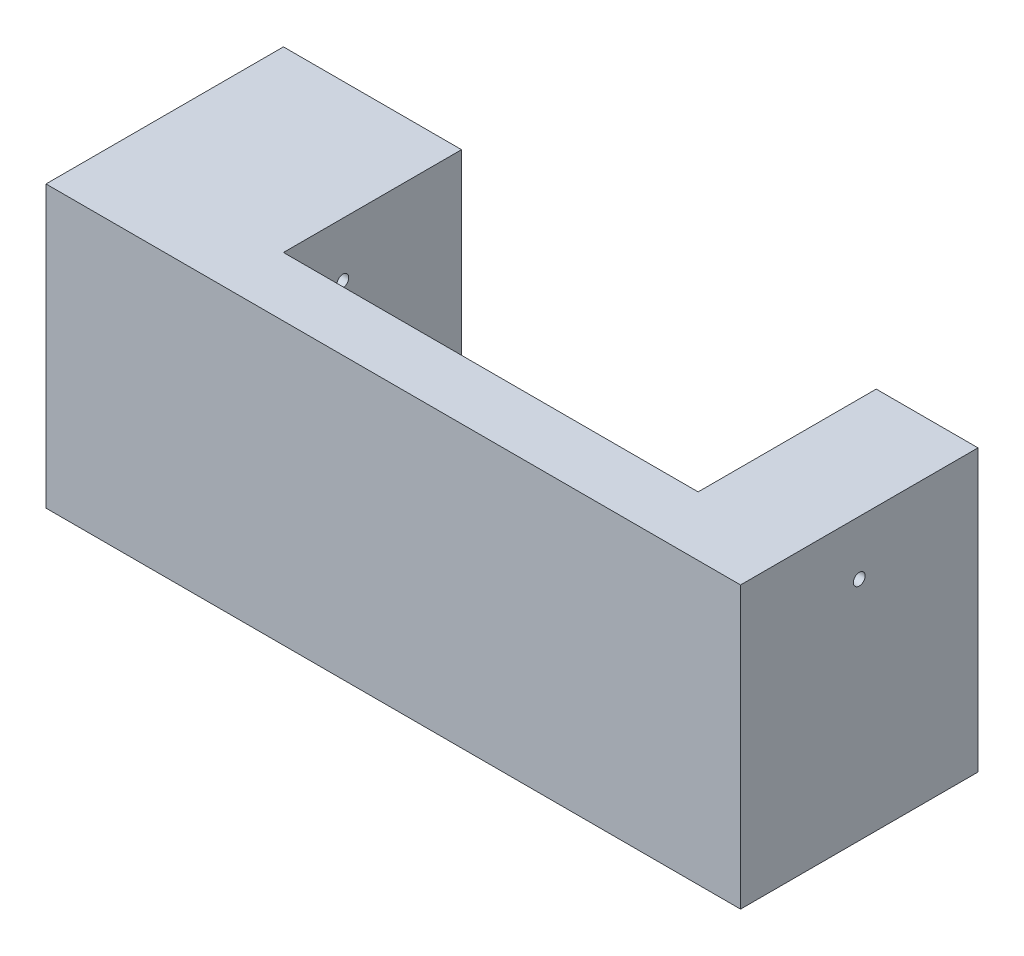
ISO-10303-21;
HEADER;
FILE_DESCRIPTION(('STEP AP214'),'2;1');
FILE_NAME('part.step','',(''),(''),'','','');
FILE_SCHEMA(('AUTOMOTIVE_DESIGN { 1 0 10303 214 1 1 1 1 }'));
ENDSEC;
DATA;
#1=APPLICATION_CONTEXT('core data for automotive mechanical design processes');
#2=APPLICATION_PROTOCOL_DEFINITION('international standard','automotive_design',2000,#1);
#3=PRODUCT_CONTEXT('',#1,'mechanical');
#4=PRODUCT('Part','Part','',(#3));
#5=PRODUCT_RELATED_PRODUCT_CATEGORY('part','',(#4));
#6=PRODUCT_DEFINITION_FORMATION('','',#4);
#7=PRODUCT_DEFINITION_CONTEXT('part definition',#1,'design');
#8=PRODUCT_DEFINITION('design','',#6,#7);
#9=PRODUCT_DEFINITION_SHAPE('','',#8);
#10=(LENGTH_UNIT() NAMED_UNIT(*) SI_UNIT(.MILLI.,.METRE.));
#11=(NAMED_UNIT(*) PLANE_ANGLE_UNIT() SI_UNIT($,.RADIAN.));
#12=(NAMED_UNIT(*) SI_UNIT($,.STERADIAN.) SOLID_ANGLE_UNIT());
#13=UNCERTAINTY_MEASURE_WITH_UNIT(LENGTH_MEASURE(1.E-05),#10,'distance_accuracy_value','');
#14=(GEOMETRIC_REPRESENTATION_CONTEXT(3) GLOBAL_UNCERTAINTY_ASSIGNED_CONTEXT((#13)) GLOBAL_UNIT_ASSIGNED_CONTEXT((#10,
#11,#12)) REPRESENTATION_CONTEXT('',''));
#15=CARTESIAN_POINT('',(0.,0.,0.));
#16=DIRECTION('',(0.,0.,1.));
#17=DIRECTION('',(1.,0.,0.));
#18=AXIS2_PLACEMENT_3D('',#15,#16,#17);
#19=CARTESIAN_POINT('',(117.,23.65,9.99999999999999));
#20=DIRECTION('',(0.,0.,1.));
#21=DIRECTION('',(0.,-1.,0.));
#22=AXIS2_PLACEMENT_3D('',#19,#20,#21);
#23=PLANE('',#22);
#24=DIRECTION('',(0.,1.,0.));
#25=VECTOR('',#24,1.);
#26=CARTESIAN_POINT('',(99.8539832396308,23.65,9.99999999999999));
#27=LINE('',#26,#25);
#28=CARTESIAN_POINT('',(99.8539832396308,-23.65,9.99999999999999));
#29=VERTEX_POINT('',#28);
#30=CARTESIAN_POINT('',(99.8539832396308,23.65,9.99999999999999));
#31=VERTEX_POINT('',#30);
#32=EDGE_CURVE('E179',#29,#31,#27,.T.);
#33=ORIENTED_EDGE('',*,*,#32,.F.);
#34=DIRECTION('',(-1.,0.,0.));
#35=VECTOR('',#34,1.);
#36=CARTESIAN_POINT('',(117.,-23.65,9.99999999999999));
#37=LINE('',#36,#35);
#38=CARTESIAN_POINT('',(30.,-23.65,9.99999999999999));
#39=VERTEX_POINT('',#38);
#40=EDGE_CURVE('E56',#29,#39,#37,.T.);
#41=ORIENTED_EDGE('',*,*,#40,.T.);
#42=DIRECTION('',(0.,1.,0.));
#43=VECTOR('',#42,1.);
#44=CARTESIAN_POINT('',(30.,23.65,9.99999999999999));
#45=LINE('',#44,#43);
#46=CARTESIAN_POINT('',(30.,23.65,9.99999999999999));
#47=VERTEX_POINT('',#46);
#48=EDGE_CURVE('E159',#39,#47,#45,.T.);
#49=ORIENTED_EDGE('',*,*,#48,.T.);
#50=DIRECTION('',(-1.,0.,0.));
#51=VECTOR('',#50,1.);
#52=CARTESIAN_POINT('',(117.,23.65,9.99999999999999));
#53=LINE('',#52,#51);
#54=EDGE_CURVE('E149',#31,#47,#53,.T.);
#55=ORIENTED_EDGE('',*,*,#54,.F.);
#56=EDGE_LOOP('',(#33,#41,#49,#55));
#57=FACE_BOUND('',#56,.T.);
#58=ADVANCED_FACE('F39',(#57),#23,.F.);
#59=CARTESIAN_POINT('',(30.,0.,0.));
#60=DIRECTION('',(-1.,0.,0.));
#61=DIRECTION('',(0.,0.,1.));
#62=AXIS2_PLACEMENT_3D('',#59,#60,#61);
#63=PLANE('',#62);
#64=CARTESIAN_POINT('',(30.,14.4893111638955,0.));
#65=DIRECTION('',(1.,0.,0.));
#66=DIRECTION('',(0.,0.,-1.));
#67=AXIS2_PLACEMENT_3D('',#64,#65,#66);
#68=CIRCLE('',#67,1.);
#69=CARTESIAN_POINT('',(30.,14.4893111638955,-1.));
#70=VERTEX_POINT('',#69);
#71=EDGE_CURVE('E109',#70,#70,#68,.T.);
#72=ORIENTED_EDGE('',*,*,#71,.F.);
#73=EDGE_LOOP('',(#72));
#74=FACE_BOUND('',#73,.T.);
#75=ORIENTED_EDGE('',*,*,#48,.F.);
#76=DIRECTION('',(0.,0.,-1.));
#77=VECTOR('',#76,1.);
#78=CARTESIAN_POINT('',(30.,-23.65,20.));
#79=LINE('',#78,#77);
#80=CARTESIAN_POINT('',(30.,-23.65,-20.));
#81=VERTEX_POINT('',#80);
#82=EDGE_CURVE('E64',#39,#81,#79,.T.);
#83=ORIENTED_EDGE('',*,*,#82,.T.);
#84=DIRECTION('',(0.,1.,0.));
#85=VECTOR('',#84,1.);
#86=CARTESIAN_POINT('',(30.,-23.65,-20.));
#87=LINE('',#86,#85);
#88=CARTESIAN_POINT('',(30.,23.65,-20.));
#89=VERTEX_POINT('',#88);
#90=EDGE_CURVE('E96',#81,#89,#87,.T.);
#91=ORIENTED_EDGE('',*,*,#90,.T.);
#92=DIRECTION('',(0.,0.,1.));
#93=VECTOR('',#92,1.);
#94=CARTESIAN_POINT('',(30.,23.65,20.));
#95=LINE('',#94,#93);
#96=EDGE_CURVE('E169',#89,#47,#95,.T.);
#97=ORIENTED_EDGE('',*,*,#96,.T.);
#98=EDGE_LOOP('',(#75,#83,#91,#97));
#99=FACE_BOUND('',#98,.T.);
#100=ADVANCED_FACE('F174',(#74,#99),#63,.F.);
#101=CARTESIAN_POINT('',(0.,0.,0.));
#102=DIRECTION('',(-1.,0.,0.));
#103=DIRECTION('',(0.,0.,1.));
#104=AXIS2_PLACEMENT_3D('',#101,#102,#103);
#105=PLANE('',#104);
#106=DIRECTION('',(0.,1.,0.));
#107=VECTOR('',#106,1.);
#108=CARTESIAN_POINT('',(0.,-23.65,-20.));
#109=LINE('',#108,#107);
#110=CARTESIAN_POINT('',(0.,-23.65,-20.));
#111=VERTEX_POINT('',#110);
#112=CARTESIAN_POINT('',(0.,23.65,-20.));
#113=VERTEX_POINT('',#112);
#114=EDGE_CURVE('E102',#111,#113,#109,.T.);
#115=ORIENTED_EDGE('',*,*,#114,.F.);
#116=DIRECTION('',(0.,0.,-1.));
#117=VECTOR('',#116,1.);
#118=CARTESIAN_POINT('',(0.,-23.65,20.));
#119=LINE('',#118,#117);
#120=CARTESIAN_POINT('',(0.,-23.65,20.));
#121=VERTEX_POINT('',#120);
#122=EDGE_CURVE('E84',#121,#111,#119,.T.);
#123=ORIENTED_EDGE('',*,*,#122,.F.);
#124=DIRECTION('',(0.,-1.,0.));
#125=VECTOR('',#124,1.);
#126=CARTESIAN_POINT('',(0.,-23.65,20.));
#127=LINE('',#126,#125);
#128=CARTESIAN_POINT('',(0.,23.65,20.));
#129=VERTEX_POINT('',#128);
#130=EDGE_CURVE('E97',#129,#121,#127,.T.);
#131=ORIENTED_EDGE('',*,*,#130,.F.);
#132=DIRECTION('',(0.,0.,1.));
#133=VECTOR('',#132,1.);
#134=CARTESIAN_POINT('',(0.,23.65,20.));
#135=LINE('',#134,#133);
#136=EDGE_CURVE('E107',#113,#129,#135,.T.);
#137=ORIENTED_EDGE('',*,*,#136,.F.);
#138=EDGE_LOOP('',(#115,#123,#131,#137));
#139=FACE_BOUND('',#138,.T.);
#140=CARTESIAN_POINT('',(0.,14.4893111638955,0.));
#141=DIRECTION('',(1.,0.,0.));
#142=DIRECTION('',(0.,0.,-1.));
#143=AXIS2_PLACEMENT_3D('',#140,#141,#142);
#144=CIRCLE('',#143,1.);
#145=CARTESIAN_POINT('',(0.,14.4893111638955,-1.));
#146=VERTEX_POINT('',#145);
#147=EDGE_CURVE('E115',#146,#146,#144,.T.);
#148=ORIENTED_EDGE('',*,*,#147,.T.);
#149=EDGE_LOOP('',(#148));
#150=FACE_BOUND('',#149,.T.);
#151=ADVANCED_FACE('F105',(#139,#150),#105,.T.);
#152=CARTESIAN_POINT('',(30.,-23.65,-20.));
#153=DIRECTION('',(0.,0.,1.));
#154=DIRECTION('',(1.,0.,0.));
#155=AXIS2_PLACEMENT_3D('',#152,#153,#154);
#156=PLANE('',#155);
#157=ORIENTED_EDGE('',*,*,#114,.T.);
#158=DIRECTION('',(-1.,0.,0.));
#159=VECTOR('',#158,1.);
#160=CARTESIAN_POINT('',(30.,23.65,-20.));
#161=LINE('',#160,#159);
#162=EDGE_CURVE('E11',#89,#113,#161,.T.);
#163=ORIENTED_EDGE('',*,*,#162,.F.);
#164=ORIENTED_EDGE('',*,*,#90,.F.);
#165=DIRECTION('',(-1.,0.,0.));
#166=VECTOR('',#165,1.);
#167=CARTESIAN_POINT('',(30.,-23.65,-20.));
#168=LINE('',#167,#166);
#169=EDGE_CURVE('E87',#81,#111,#168,.T.);
#170=ORIENTED_EDGE('',*,*,#169,.T.);
#171=EDGE_LOOP('',(#157,#163,#164,#170));
#172=FACE_BOUND('',#171,.T.);
#173=ADVANCED_FACE('F41',(#172),#156,.F.);
#174=CARTESIAN_POINT('',(30.,23.65,20.));
#175=DIRECTION('',(0.,-1.,0.));
#176=DIRECTION('',(0.,0.,-1.));
#177=AXIS2_PLACEMENT_3D('',#174,#175,#176);
#178=PLANE('',#177);
#179=ORIENTED_EDGE('',*,*,#136,.T.);
#180=DIRECTION('',(-1.,0.,0.));
#181=VECTOR('',#180,1.);
#182=CARTESIAN_POINT('',(30.,23.65,20.));
#183=LINE('',#182,#181);
#184=CARTESIAN_POINT('',(117.,23.65,20.));
#185=VERTEX_POINT('',#184);
#186=EDGE_CURVE('E49',#185,#129,#183,.T.);
#187=ORIENTED_EDGE('',*,*,#186,.F.);
#188=DIRECTION('',(0.,0.,1.));
#189=VECTOR('',#188,1.);
#190=CARTESIAN_POINT('',(117.,23.65,20.));
#191=LINE('',#190,#189);
#192=CARTESIAN_POINT('',(117.,23.65,-20.));
#193=VERTEX_POINT('',#192);
#194=EDGE_CURVE('E138',#193,#185,#191,.T.);
#195=ORIENTED_EDGE('',*,*,#194,.F.);
#196=DIRECTION('',(1.,0.,0.));
#197=VECTOR('',#196,1.);
#198=CARTESIAN_POINT('',(117.,23.65,-20.));
#199=LINE('',#198,#197);
#200=CARTESIAN_POINT('',(99.8539832396308,23.65,-20.));
#201=VERTEX_POINT('',#200);
#202=EDGE_CURVE('E186',#201,#193,#199,.T.);
#203=ORIENTED_EDGE('',*,*,#202,.F.);
#204=DIRECTION('',(0.,0.,1.));
#205=VECTOR('',#204,1.);
#206=CARTESIAN_POINT('',(99.8539832396308,23.65,-20.));
#207=LINE('',#206,#205);
#208=EDGE_CURVE('E184',#201,#31,#207,.T.);
#209=ORIENTED_EDGE('',*,*,#208,.T.);
#210=ORIENTED_EDGE('',*,*,#54,.T.);
#211=ORIENTED_EDGE('',*,*,#96,.F.);
#212=ORIENTED_EDGE('',*,*,#162,.T.);
#213=EDGE_LOOP('',(#179,#187,#195,#203,#209,#210,#211,#212));
#214=FACE_BOUND('',#213,.T.);
#215=ADVANCED_FACE('F135',(#214),#178,.F.);
#216=CARTESIAN_POINT('',(30.,-23.65,20.));
#217=DIRECTION('',(0.,0.,-1.));
#218=DIRECTION('',(-1.,0.,0.));
#219=AXIS2_PLACEMENT_3D('',#216,#217,#218);
#220=PLANE('',#219);
#221=ORIENTED_EDGE('',*,*,#130,.T.);
#222=DIRECTION('',(-1.,0.,0.));
#223=VECTOR('',#222,1.);
#224=CARTESIAN_POINT('',(30.,-23.65,20.));
#225=LINE('',#224,#223);
#226=CARTESIAN_POINT('',(117.,-23.65,20.));
#227=VERTEX_POINT('',#226);
#228=EDGE_CURVE('E91',#227,#121,#225,.T.);
#229=ORIENTED_EDGE('',*,*,#228,.F.);
#230=DIRECTION('',(0.,-1.,0.));
#231=VECTOR('',#230,1.);
#232=CARTESIAN_POINT('',(117.,23.65,20.));
#233=LINE('',#232,#231);
#234=EDGE_CURVE('E131',#185,#227,#233,.T.);
#235=ORIENTED_EDGE('',*,*,#234,.F.);
#236=ORIENTED_EDGE('',*,*,#186,.T.);
#237=EDGE_LOOP('',(#221,#229,#235,#236));
#238=FACE_BOUND('',#237,.T.);
#239=ADVANCED_FACE('F129',(#238),#220,.F.);
#240=CARTESIAN_POINT('',(30.,-23.65,20.));
#241=DIRECTION('',(0.,1.,0.));
#242=DIRECTION('',(0.,0.,1.));
#243=AXIS2_PLACEMENT_3D('',#240,#241,#242);
#244=PLANE('',#243);
#245=ORIENTED_EDGE('',*,*,#122,.T.);
#246=ORIENTED_EDGE('',*,*,#169,.F.);
#247=ORIENTED_EDGE('',*,*,#82,.F.);
#248=ORIENTED_EDGE('',*,*,#40,.F.);
#249=DIRECTION('',(0.,0.,1.));
#250=VECTOR('',#249,1.);
#251=CARTESIAN_POINT('',(99.8539832396308,-23.65,-20.));
#252=LINE('',#251,#250);
#253=CARTESIAN_POINT('',(99.8539832396308,-23.65,-20.));
#254=VERTEX_POINT('',#253);
#255=EDGE_CURVE('E161',#254,#29,#252,.T.);
#256=ORIENTED_EDGE('',*,*,#255,.F.);
#257=DIRECTION('',(-1.,0.,0.));
#258=VECTOR('',#257,1.);
#259=CARTESIAN_POINT('',(117.,-23.65,-20.));
#260=LINE('',#259,#258);
#261=CARTESIAN_POINT('',(117.,-23.65,-20.));
#262=VERTEX_POINT('',#261);
#263=EDGE_CURVE('E204',#262,#254,#260,.T.);
#264=ORIENTED_EDGE('',*,*,#263,.F.);
#265=DIRECTION('',(0.,0.,-1.));
#266=VECTOR('',#265,1.);
#267=CARTESIAN_POINT('',(117.,-23.65,20.));
#268=LINE('',#267,#266);
#269=EDGE_CURVE('E150',#227,#262,#268,.T.);
#270=ORIENTED_EDGE('',*,*,#269,.F.);
#271=ORIENTED_EDGE('',*,*,#228,.T.);
#272=EDGE_LOOP('',(#245,#246,#247,#248,#256,#264,#270,#271));
#273=FACE_BOUND('',#272,.T.);
#274=ADVANCED_FACE('F86',(#273),#244,.F.);
#275=CARTESIAN_POINT('',(30.,14.4893111638955,0.));
#276=DIRECTION('',(-1.,0.,0.));
#277=DIRECTION('',(0.,0.,1.));
#278=AXIS2_PLACEMENT_3D('',#275,#276,#277);
#279=CYLINDRICAL_SURFACE('',#278,1.);
#280=ORIENTED_EDGE('',*,*,#71,.T.);
#281=EDGE_LOOP('',(#280));
#282=FACE_BOUND('',#281,.T.);
#283=ORIENTED_EDGE('',*,*,#147,.F.);
#284=EDGE_LOOP('',(#283));
#285=FACE_BOUND('',#284,.T.);
#286=ADVANCED_FACE('F241',(#282,#285),#279,.F.);
#287=CARTESIAN_POINT('',(117.,0.,0.));
#288=DIRECTION('',(1.,0.,0.));
#289=DIRECTION('',(0.,0.,-1.));
#290=AXIS2_PLACEMENT_3D('',#287,#288,#289);
#291=PLANE('',#290);
#292=CARTESIAN_POINT('',(117.,14.4893111638955,0.));
#293=DIRECTION('',(-1.,0.,0.));
#294=DIRECTION('',(0.,0.,1.));
#295=AXIS2_PLACEMENT_3D('',#292,#293,#294);
#296=CIRCLE('',#295,1.);
#297=CARTESIAN_POINT('',(117.,14.4893111638955,1.));
#298=VERTEX_POINT('',#297);
#299=EDGE_CURVE('E210',#298,#298,#296,.T.);
#300=ORIENTED_EDGE('',*,*,#299,.T.);
#301=EDGE_LOOP('',(#300));
#302=FACE_BOUND('',#301,.T.);
#303=ORIENTED_EDGE('',*,*,#234,.T.);
#304=ORIENTED_EDGE('',*,*,#269,.T.);
#305=DIRECTION('',(0.,-1.,0.));
#306=VECTOR('',#305,1.);
#307=CARTESIAN_POINT('',(117.,23.65,-20.));
#308=LINE('',#307,#306);
#309=EDGE_CURVE('E147',#193,#262,#308,.T.);
#310=ORIENTED_EDGE('',*,*,#309,.F.);
#311=ORIENTED_EDGE('',*,*,#194,.T.);
#312=EDGE_LOOP('',(#303,#304,#310,#311));
#313=FACE_BOUND('',#312,.T.);
#314=ADVANCED_FACE('F144',(#302,#313),#291,.T.);
#315=CARTESIAN_POINT('',(99.8539832396308,23.65,-20.));
#316=DIRECTION('',(1.,0.,0.));
#317=DIRECTION('',(0.,0.,-1.));
#318=AXIS2_PLACEMENT_3D('',#315,#316,#317);
#319=PLANE('',#318);
#320=CARTESIAN_POINT('',(99.8539832396308,14.4893111638955,0.));
#321=DIRECTION('',(1.,0.,0.));
#322=DIRECTION('',(0.,0.,-1.));
#323=AXIS2_PLACEMENT_3D('',#320,#321,#322);
#324=CIRCLE('',#323,1.);
#325=CARTESIAN_POINT('',(99.8539832396308,14.4893111638955,-1.));
#326=VERTEX_POINT('',#325);
#327=EDGE_CURVE('E43',#326,#326,#324,.T.);
#328=ORIENTED_EDGE('',*,*,#327,.T.);
#329=EDGE_LOOP('',(#328));
#330=FACE_BOUND('',#329,.T.);
#331=ORIENTED_EDGE('',*,*,#32,.T.);
#332=ORIENTED_EDGE('',*,*,#208,.F.);
#333=DIRECTION('',(0.,1.,0.));
#334=VECTOR('',#333,1.);
#335=CARTESIAN_POINT('',(99.8539832396308,23.65,-20.));
#336=LINE('',#335,#334);
#337=EDGE_CURVE('E195',#254,#201,#336,.T.);
#338=ORIENTED_EDGE('',*,*,#337,.F.);
#339=ORIENTED_EDGE('',*,*,#255,.T.);
#340=EDGE_LOOP('',(#331,#332,#338,#339));
#341=FACE_BOUND('',#340,.T.);
#342=ADVANCED_FACE('F219',(#330,#341),#319,.F.);
#343=CARTESIAN_POINT('',(0.,0.,-20.));
#344=DIRECTION('',(0.,0.,-1.));
#345=DIRECTION('',(0.,1.,0.));
#346=AXIS2_PLACEMENT_3D('',#343,#344,#345);
#347=PLANE('',#346);
#348=ORIENTED_EDGE('',*,*,#309,.T.);
#349=ORIENTED_EDGE('',*,*,#263,.T.);
#350=ORIENTED_EDGE('',*,*,#337,.T.);
#351=ORIENTED_EDGE('',*,*,#202,.T.);
#352=EDGE_LOOP('',(#348,#349,#350,#351));
#353=FACE_BOUND('',#352,.T.);
#354=ADVANCED_FACE('F223',(#353),#347,.T.);
#355=CARTESIAN_POINT('',(117.,14.4893111638955,0.));
#356=DIRECTION('',(-1.,0.,0.));
#357=DIRECTION('',(0.,0.,1.));
#358=AXIS2_PLACEMENT_3D('',#355,#356,#357);
#359=CYLINDRICAL_SURFACE('',#358,1.);
#360=ORIENTED_EDGE('',*,*,#299,.F.);
#361=EDGE_LOOP('',(#360));
#362=FACE_BOUND('',#361,.T.);
#363=ORIENTED_EDGE('',*,*,#327,.F.);
#364=EDGE_LOOP('',(#363));
#365=FACE_BOUND('',#364,.T.);
#366=ADVANCED_FACE('F221',(#362,#365),#359,.F.);
#367=CLOSED_SHELL('',(#58,#100,#151,#173,#215,#239,#274,#286,#314,#342,#354,#366));
#368=MANIFOLD_SOLID_BREP('B2',#367);
#369=ADVANCED_BREP_SHAPE_REPRESENTATION('',(#18,#368),#14);
#370=SHAPE_DEFINITION_REPRESENTATION(#9,#369);
ENDSEC;
END-ISO-10303-21;
